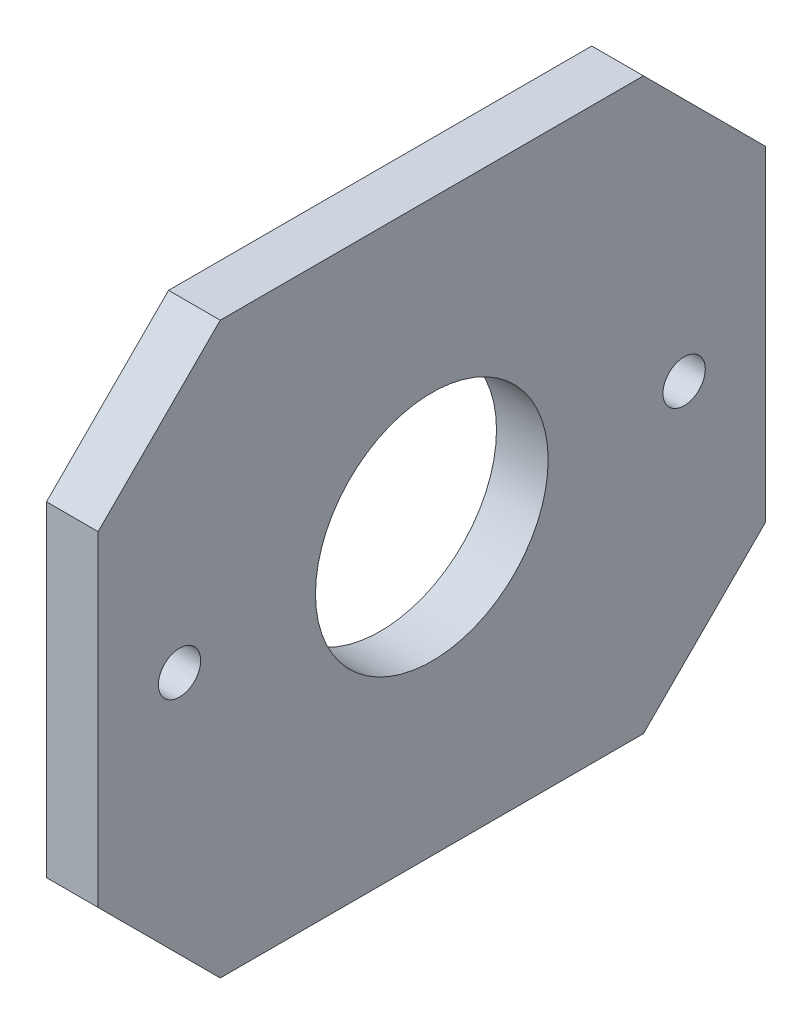
ISO-10303-21;
HEADER;
FILE_DESCRIPTION(('STEP AP214'),'2;1');
FILE_NAME('part.step','',(''),(''),'','','');
FILE_SCHEMA(('AUTOMOTIVE_DESIGN { 1 0 10303 214 1 1 1 1 }'));
ENDSEC;
DATA;
#1=APPLICATION_CONTEXT('core data for automotive mechanical design processes');
#2=APPLICATION_PROTOCOL_DEFINITION('international standard','automotive_design',2000,#1);
#3=PRODUCT_CONTEXT('',#1,'mechanical');
#4=PRODUCT('Part','Part','',(#3));
#5=PRODUCT_RELATED_PRODUCT_CATEGORY('part','',(#4));
#6=PRODUCT_DEFINITION_FORMATION('','',#4);
#7=PRODUCT_DEFINITION_CONTEXT('part definition',#1,'design');
#8=PRODUCT_DEFINITION('design','',#6,#7);
#9=PRODUCT_DEFINITION_SHAPE('','',#8);
#10=(LENGTH_UNIT() NAMED_UNIT(*) SI_UNIT(.MILLI.,.METRE.));
#11=(NAMED_UNIT(*) PLANE_ANGLE_UNIT() SI_UNIT($,.RADIAN.));
#12=(NAMED_UNIT(*) SI_UNIT($,.STERADIAN.) SOLID_ANGLE_UNIT());
#13=UNCERTAINTY_MEASURE_WITH_UNIT(LENGTH_MEASURE(1.E-05),#10,'distance_accuracy_value','');
#14=(GEOMETRIC_REPRESENTATION_CONTEXT(3) GLOBAL_UNCERTAINTY_ASSIGNED_CONTEXT((#13)) GLOBAL_UNIT_ASSIGNED_CONTEXT((#10,
#11,#12)) REPRESENTATION_CONTEXT('',''));
#15=CARTESIAN_POINT('',(0.,0.,0.));
#16=DIRECTION('',(0.,0.,1.));
#17=DIRECTION('',(1.,0.,0.));
#18=AXIS2_PLACEMENT_3D('',#15,#16,#17);
#19=CARTESIAN_POINT('',(6.35,0.,0.));
#20=DIRECTION('',(1.,0.,0.));
#21=DIRECTION('',(0.,0.,-1.));
#22=AXIS2_PLACEMENT_3D('',#19,#20,#21);
#23=PLANE('',#22);
#24=CARTESIAN_POINT('',(6.35,0.,31.));
#25=DIRECTION('',(1.,0.,0.));
#26=DIRECTION('',(0.,0.,-1.));
#27=AXIS2_PLACEMENT_3D('',#24,#25,#26);
#28=CIRCLE('',#27,2.6);
#29=CARTESIAN_POINT('',(6.35,0.,28.4));
#30=VERTEX_POINT('',#29);
#31=EDGE_CURVE('E184',#30,#30,#28,.T.);
#32=ORIENTED_EDGE('',*,*,#31,.F.);
#33=EDGE_LOOP('',(#32));
#34=FACE_BOUND('',#33,.T.);
#35=DIRECTION('',(0.,1.,0.));
#36=VECTOR('',#35,1.);
#37=CARTESIAN_POINT('',(6.35,35.,-41.));
#38=LINE('',#37,#36);
#39=CARTESIAN_POINT('',(6.35,-20.,-41.));
#40=VERTEX_POINT('',#39);
#41=CARTESIAN_POINT('',(6.35,19.9999999999999,-41.));
#42=VERTEX_POINT('',#41);
#43=EDGE_CURVE('E179',#40,#42,#38,.T.);
#44=ORIENTED_EDGE('',*,*,#43,.T.);
#45=DIRECTION('',(0.,-0.707106781186549,-0.707106781186546));
#46=VECTOR('',#45,1.);
#47=CARTESIAN_POINT('',(6.35,30.4999999999999,-30.5));
#48=LINE('',#47,#46);
#49=CARTESIAN_POINT('',(6.35,35.,-26.));
#50=VERTEX_POINT('',#49);
#51=EDGE_CURVE('E156',#42,#50,#48,.F.);
#52=ORIENTED_EDGE('',*,*,#51,.T.);
#53=DIRECTION('',(0.,0.,1.));
#54=VECTOR('',#53,1.);
#55=CARTESIAN_POINT('',(6.35,35.,41.));
#56=LINE('',#55,#54);
#57=CARTESIAN_POINT('',(6.35,35.,25.9999999999999));
#58=VERTEX_POINT('',#57);
#59=EDGE_CURVE('E127',#50,#58,#56,.T.);
#60=ORIENTED_EDGE('',*,*,#59,.T.);
#61=DIRECTION('',(0.,0.707106781186546,-0.707106781186549));
#62=VECTOR('',#61,1.);
#63=CARTESIAN_POINT('',(6.35,30.5,30.4999999999999));
#64=LINE('',#63,#62);
#65=CARTESIAN_POINT('',(6.35,20.,41.));
#66=VERTEX_POINT('',#65);
#67=EDGE_CURVE('E151',#58,#66,#64,.F.);
#68=ORIENTED_EDGE('',*,*,#67,.T.);
#69=DIRECTION('',(0.,-1.,0.));
#70=VECTOR('',#69,1.);
#71=CARTESIAN_POINT('',(6.35,35.,41.));
#72=LINE('',#71,#70);
#73=CARTESIAN_POINT('',(6.35,-19.9999999999999,41.));
#74=VERTEX_POINT('',#73);
#75=EDGE_CURVE('E134',#66,#74,#72,.T.);
#76=ORIENTED_EDGE('',*,*,#75,.T.);
#77=DIRECTION('',(0.,0.707106781186549,0.707106781186546));
#78=VECTOR('',#77,1.);
#79=CARTESIAN_POINT('',(6.35,-30.4999999999999,30.5));
#80=LINE('',#79,#78);
#81=CARTESIAN_POINT('',(6.35,-35.,26.));
#82=VERTEX_POINT('',#81);
#83=EDGE_CURVE('E63',#74,#82,#80,.F.);
#84=ORIENTED_EDGE('',*,*,#83,.T.);
#85=DIRECTION('',(0.,0.,-1.));
#86=VECTOR('',#85,1.);
#87=CARTESIAN_POINT('',(6.35,-35.,41.));
#88=LINE('',#87,#86);
#89=CARTESIAN_POINT('',(6.35,-35.,-25.9999999999999));
#90=VERTEX_POINT('',#89);
#91=EDGE_CURVE('E137',#82,#90,#88,.T.);
#92=ORIENTED_EDGE('',*,*,#91,.T.);
#93=DIRECTION('',(0.,-0.707106781186546,0.707106781186549));
#94=VECTOR('',#93,1.);
#95=CARTESIAN_POINT('',(6.35,-30.5,-30.4999999999999));
#96=LINE('',#95,#94);
#97=EDGE_CURVE('E154',#90,#40,#96,.F.);
#98=ORIENTED_EDGE('',*,*,#97,.T.);
#99=EDGE_LOOP('',(#44,#52,#60,#68,#76,#84,#92,#98));
#100=FACE_BOUND('',#99,.T.);
#101=CARTESIAN_POINT('',(6.35,0.,0.));
#102=DIRECTION('',(1.,0.,0.));
#103=DIRECTION('',(0.,0.,-1.));
#104=AXIS2_PLACEMENT_3D('',#101,#102,#103);
#105=CIRCLE('',#104,14.295);
#106=CARTESIAN_POINT('',(6.35,0.,-14.295));
#107=VERTEX_POINT('',#106);
#108=EDGE_CURVE('E172',#107,#107,#105,.T.);
#109=ORIENTED_EDGE('',*,*,#108,.F.);
#110=EDGE_LOOP('',(#109));
#111=FACE_BOUND('',#110,.T.);
#112=CARTESIAN_POINT('',(6.35,0.,-31.));
#113=DIRECTION('',(1.,0.,0.));
#114=DIRECTION('',(0.,0.,-1.));
#115=AXIS2_PLACEMENT_3D('',#112,#113,#114);
#116=CIRCLE('',#115,2.59999999999999);
#117=CARTESIAN_POINT('',(6.35,0.,-33.6));
#118=VERTEX_POINT('',#117);
#119=EDGE_CURVE('E189',#118,#118,#116,.T.);
#120=ORIENTED_EDGE('',*,*,#119,.F.);
#121=EDGE_LOOP('',(#120));
#122=FACE_BOUND('',#121,.T.);
#123=ADVANCED_FACE('F40',(#34,#100,#111,#122),#23,.T.);
#124=CARTESIAN_POINT('',(0.,0.,0.));
#125=DIRECTION('',(1.,0.,0.));
#126=DIRECTION('',(0.,0.,-1.));
#127=AXIS2_PLACEMENT_3D('',#124,#125,#126);
#128=PLANE('',#127);
#129=DIRECTION('',(0.,0.,1.));
#130=VECTOR('',#129,1.);
#131=CARTESIAN_POINT('',(0.,35.,41.));
#132=LINE('',#131,#130);
#133=CARTESIAN_POINT('',(0.,35.,-26.));
#134=VERTEX_POINT('',#133);
#135=CARTESIAN_POINT('',(0.,35.,25.9999999999999));
#136=VERTEX_POINT('',#135);
#137=EDGE_CURVE('E124',#134,#136,#132,.T.);
#138=ORIENTED_EDGE('',*,*,#137,.F.);
#139=DIRECTION('',(0.,0.707106781186549,0.707106781186546));
#140=VECTOR('',#139,1.);
#141=CARTESIAN_POINT('',(0.,35.,-26.));
#142=LINE('',#141,#140);
#143=CARTESIAN_POINT('',(0.,19.9999999999999,-41.));
#144=VERTEX_POINT('',#143);
#145=EDGE_CURVE('E107',#134,#144,#142,.F.);
#146=ORIENTED_EDGE('',*,*,#145,.T.);
#147=DIRECTION('',(0.,1.,0.));
#148=VECTOR('',#147,1.);
#149=CARTESIAN_POINT('',(0.,35.,-41.));
#150=LINE('',#149,#148);
#151=CARTESIAN_POINT('',(0.,-20.,-41.));
#152=VERTEX_POINT('',#151);
#153=EDGE_CURVE('E135',#152,#144,#150,.T.);
#154=ORIENTED_EDGE('',*,*,#153,.F.);
#155=DIRECTION('',(0.,0.707106781186546,-0.707106781186549));
#156=VECTOR('',#155,1.);
#157=CARTESIAN_POINT('',(0.,-20.,-41.));
#158=LINE('',#157,#156);
#159=CARTESIAN_POINT('',(0.,-35.,-25.9999999999999));
#160=VERTEX_POINT('',#159);
#161=EDGE_CURVE('E118',#152,#160,#158,.F.);
#162=ORIENTED_EDGE('',*,*,#161,.T.);
#163=DIRECTION('',(0.,0.,-1.));
#164=VECTOR('',#163,1.);
#165=CARTESIAN_POINT('',(0.,-35.,41.));
#166=LINE('',#165,#164);
#167=CARTESIAN_POINT('',(0.,-35.,26.));
#168=VERTEX_POINT('',#167);
#169=EDGE_CURVE('E139',#168,#160,#166,.T.);
#170=ORIENTED_EDGE('',*,*,#169,.F.);
#171=DIRECTION('',(0.,-0.707106781186549,-0.707106781186546));
#172=VECTOR('',#171,1.);
#173=CARTESIAN_POINT('',(0.,-35.,26.));
#174=LINE('',#173,#172);
#175=CARTESIAN_POINT('',(0.,-19.9999999999999,41.));
#176=VERTEX_POINT('',#175);
#177=EDGE_CURVE('E145',#168,#176,#174,.F.);
#178=ORIENTED_EDGE('',*,*,#177,.T.);
#179=DIRECTION('',(0.,-1.,0.));
#180=VECTOR('',#179,1.);
#181=CARTESIAN_POINT('',(0.,35.,41.));
#182=LINE('',#181,#180);
#183=CARTESIAN_POINT('',(0.,20.,41.));
#184=VERTEX_POINT('',#183);
#185=EDGE_CURVE('E167',#184,#176,#182,.T.);
#186=ORIENTED_EDGE('',*,*,#185,.F.);
#187=DIRECTION('',(0.,-0.707106781186546,0.707106781186549));
#188=VECTOR('',#187,1.);
#189=CARTESIAN_POINT('',(0.,20.,41.));
#190=LINE('',#189,#188);
#191=EDGE_CURVE('E128',#184,#136,#190,.F.);
#192=ORIENTED_EDGE('',*,*,#191,.T.);
#193=EDGE_LOOP('',(#138,#146,#154,#162,#170,#178,#186,#192));
#194=FACE_BOUND('',#193,.T.);
#195=CARTESIAN_POINT('',(0.,0.,0.));
#196=DIRECTION('',(1.,0.,0.));
#197=DIRECTION('',(0.,0.,-1.));
#198=AXIS2_PLACEMENT_3D('',#195,#196,#197);
#199=CIRCLE('',#198,14.295);
#200=CARTESIAN_POINT('',(0.,0.,-14.295));
#201=VERTEX_POINT('',#200);
#202=EDGE_CURVE('E175',#201,#201,#199,.T.);
#203=ORIENTED_EDGE('',*,*,#202,.T.);
#204=EDGE_LOOP('',(#203));
#205=FACE_BOUND('',#204,.T.);
#206=CARTESIAN_POINT('',(0.,0.,31.));
#207=DIRECTION('',(1.,0.,0.));
#208=DIRECTION('',(0.,0.,-1.));
#209=AXIS2_PLACEMENT_3D('',#206,#207,#208);
#210=CIRCLE('',#209,2.6);
#211=CARTESIAN_POINT('',(0.,0.,28.4));
#212=VERTEX_POINT('',#211);
#213=EDGE_CURVE('E186',#212,#212,#210,.T.);
#214=ORIENTED_EDGE('',*,*,#213,.T.);
#215=EDGE_LOOP('',(#214));
#216=FACE_BOUND('',#215,.T.);
#217=CARTESIAN_POINT('',(0.,0.,-31.));
#218=DIRECTION('',(1.,0.,0.));
#219=DIRECTION('',(0.,0.,-1.));
#220=AXIS2_PLACEMENT_3D('',#217,#218,#219);
#221=CIRCLE('',#220,2.59999999999999);
#222=CARTESIAN_POINT('',(0.,0.,-33.6));
#223=VERTEX_POINT('',#222);
#224=EDGE_CURVE('E192',#223,#223,#221,.T.);
#225=ORIENTED_EDGE('',*,*,#224,.T.);
#226=EDGE_LOOP('',(#225));
#227=FACE_BOUND('',#226,.T.);
#228=ADVANCED_FACE('F131',(#194,#205,#216,#227),#128,.F.);
#229=CARTESIAN_POINT('',(6.35,35.,41.));
#230=DIRECTION('',(0.,0.,-1.));
#231=DIRECTION('',(-1.,0.,0.));
#232=AXIS2_PLACEMENT_3D('',#229,#230,#231);
#233=PLANE('',#232);
#234=ORIENTED_EDGE('',*,*,#185,.T.);
#235=DIRECTION('',(1.,0.,0.));
#236=VECTOR('',#235,1.);
#237=CARTESIAN_POINT('',(6.35,-19.9999999999999,41.));
#238=LINE('',#237,#236);
#239=EDGE_CURVE('E11',#176,#74,#238,.T.);
#240=ORIENTED_EDGE('',*,*,#239,.T.);
#241=ORIENTED_EDGE('',*,*,#75,.F.);
#242=DIRECTION('',(-1.,0.,0.));
#243=VECTOR('',#242,1.);
#244=CARTESIAN_POINT('',(6.35,20.,41.));
#245=LINE('',#244,#243);
#246=EDGE_CURVE('E49',#66,#184,#245,.T.);
#247=ORIENTED_EDGE('',*,*,#246,.T.);
#248=EDGE_LOOP('',(#234,#240,#241,#247));
#249=FACE_BOUND('',#248,.T.);
#250=ADVANCED_FACE('F166',(#249),#233,.F.);
#251=CARTESIAN_POINT('',(6.35,-35.,41.));
#252=DIRECTION('',(0.,1.,0.));
#253=DIRECTION('',(0.,0.,1.));
#254=AXIS2_PLACEMENT_3D('',#251,#252,#253);
#255=PLANE('',#254);
#256=ORIENTED_EDGE('',*,*,#169,.T.);
#257=DIRECTION('',(1.,0.,0.));
#258=VECTOR('',#257,1.);
#259=CARTESIAN_POINT('',(6.35,-35.,-25.9999999999999));
#260=LINE('',#259,#258);
#261=EDGE_CURVE('E56',#160,#90,#260,.T.);
#262=ORIENTED_EDGE('',*,*,#261,.T.);
#263=ORIENTED_EDGE('',*,*,#91,.F.);
#264=DIRECTION('',(-1.,0.,0.));
#265=VECTOR('',#264,1.);
#266=CARTESIAN_POINT('',(6.35,-35.,26.));
#267=LINE('',#266,#265);
#268=EDGE_CURVE('E158',#82,#168,#267,.T.);
#269=ORIENTED_EDGE('',*,*,#268,.T.);
#270=EDGE_LOOP('',(#256,#262,#263,#269));
#271=FACE_BOUND('',#270,.T.);
#272=ADVANCED_FACE('F219',(#271),#255,.F.);
#273=CARTESIAN_POINT('',(6.35,35.,-41.));
#274=DIRECTION('',(0.,0.,1.));
#275=DIRECTION('',(1.,0.,0.));
#276=AXIS2_PLACEMENT_3D('',#273,#274,#275);
#277=PLANE('',#276);
#278=ORIENTED_EDGE('',*,*,#153,.T.);
#279=DIRECTION('',(1.,0.,0.));
#280=VECTOR('',#279,1.);
#281=CARTESIAN_POINT('',(6.35,19.9999999999999,-41.));
#282=LINE('',#281,#280);
#283=EDGE_CURVE('E112',#144,#42,#282,.T.);
#284=ORIENTED_EDGE('',*,*,#283,.T.);
#285=ORIENTED_EDGE('',*,*,#43,.F.);
#286=DIRECTION('',(-1.,0.,0.));
#287=VECTOR('',#286,1.);
#288=CARTESIAN_POINT('',(6.35,-20.,-41.));
#289=LINE('',#288,#287);
#290=EDGE_CURVE('E117',#40,#152,#289,.T.);
#291=ORIENTED_EDGE('',*,*,#290,.T.);
#292=EDGE_LOOP('',(#278,#284,#285,#291));
#293=FACE_BOUND('',#292,.T.);
#294=ADVANCED_FACE('F216',(#293),#277,.F.);
#295=CARTESIAN_POINT('',(6.35,35.,41.));
#296=DIRECTION('',(0.,-1.,0.));
#297=DIRECTION('',(0.,0.,-1.));
#298=AXIS2_PLACEMENT_3D('',#295,#296,#297);
#299=PLANE('',#298);
#300=ORIENTED_EDGE('',*,*,#59,.F.);
#301=DIRECTION('',(-1.,0.,0.));
#302=VECTOR('',#301,1.);
#303=CARTESIAN_POINT('',(6.35,35.,-26.));
#304=LINE('',#303,#302);
#305=EDGE_CURVE('E111',#50,#134,#304,.T.);
#306=ORIENTED_EDGE('',*,*,#305,.T.);
#307=ORIENTED_EDGE('',*,*,#137,.T.);
#308=DIRECTION('',(1.,0.,0.));
#309=VECTOR('',#308,1.);
#310=CARTESIAN_POINT('',(6.35,35.,25.9999999999999));
#311=LINE('',#310,#309);
#312=EDGE_CURVE('E129',#136,#58,#311,.T.);
#313=ORIENTED_EDGE('',*,*,#312,.T.);
#314=EDGE_LOOP('',(#300,#306,#307,#313));
#315=FACE_BOUND('',#314,.T.);
#316=ADVANCED_FACE('F123',(#315),#299,.F.);
#317=CARTESIAN_POINT('',(6.35,0.,0.));
#318=DIRECTION('',(-1.,0.,0.));
#319=DIRECTION('',(0.,0.,1.));
#320=AXIS2_PLACEMENT_3D('',#317,#318,#319);
#321=CYLINDRICAL_SURFACE('',#320,14.295);
#322=ORIENTED_EDGE('',*,*,#108,.T.);
#323=EDGE_LOOP('',(#322));
#324=FACE_BOUND('',#323,.T.);
#325=ORIENTED_EDGE('',*,*,#202,.F.);
#326=EDGE_LOOP('',(#325));
#327=FACE_BOUND('',#326,.T.);
#328=ADVANCED_FACE('F211',(#324,#327),#321,.F.);
#329=CARTESIAN_POINT('',(6.35,0.,31.));
#330=DIRECTION('',(-1.,0.,0.));
#331=DIRECTION('',(0.,0.,1.));
#332=AXIS2_PLACEMENT_3D('',#329,#330,#331);
#333=CYLINDRICAL_SURFACE('',#332,2.6);
#334=ORIENTED_EDGE('',*,*,#31,.T.);
#335=EDGE_LOOP('',(#334));
#336=FACE_BOUND('',#335,.T.);
#337=ORIENTED_EDGE('',*,*,#213,.F.);
#338=EDGE_LOOP('',(#337));
#339=FACE_BOUND('',#338,.T.);
#340=ADVANCED_FACE('F254',(#336,#339),#333,.F.);
#341=CARTESIAN_POINT('',(6.35,0.,-31.));
#342=DIRECTION('',(-1.,0.,0.));
#343=DIRECTION('',(0.,0.,1.));
#344=AXIS2_PLACEMENT_3D('',#341,#342,#343);
#345=CYLINDRICAL_SURFACE('',#344,2.59999999999999);
#346=ORIENTED_EDGE('',*,*,#119,.T.);
#347=EDGE_LOOP('',(#346));
#348=FACE_BOUND('',#347,.T.);
#349=ORIENTED_EDGE('',*,*,#224,.F.);
#350=EDGE_LOOP('',(#349));
#351=FACE_BOUND('',#350,.T.);
#352=ADVANCED_FACE('F198',(#348,#351),#345,.F.);
#353=CARTESIAN_POINT('',(6.35,35.,-26.));
#354=DIRECTION('',(0.,-0.707106781186546,0.707106781186549));
#355=DIRECTION('',(-1.,0.,0.));
#356=AXIS2_PLACEMENT_3D('',#353,#354,#355);
#357=PLANE('',#356);
#358=ORIENTED_EDGE('',*,*,#51,.F.);
#359=ORIENTED_EDGE('',*,*,#283,.F.);
#360=ORIENTED_EDGE('',*,*,#145,.F.);
#361=ORIENTED_EDGE('',*,*,#305,.F.);
#362=EDGE_LOOP('',(#358,#359,#360,#361));
#363=FACE_BOUND('',#362,.T.);
#364=ADVANCED_FACE('F110',(#363),#357,.F.);
#365=CARTESIAN_POINT('',(6.35,-20.,-41.));
#366=DIRECTION('',(0.,0.707106781186549,0.707106781186546));
#367=DIRECTION('',(-1.,0.,0.));
#368=AXIS2_PLACEMENT_3D('',#365,#366,#367);
#369=PLANE('',#368);
#370=ORIENTED_EDGE('',*,*,#97,.F.);
#371=ORIENTED_EDGE('',*,*,#261,.F.);
#372=ORIENTED_EDGE('',*,*,#161,.F.);
#373=ORIENTED_EDGE('',*,*,#290,.F.);
#374=EDGE_LOOP('',(#370,#371,#372,#373));
#375=FACE_BOUND('',#374,.T.);
#376=ADVANCED_FACE('F231',(#375),#369,.F.);
#377=CARTESIAN_POINT('',(6.35,-35.,26.));
#378=DIRECTION('',(0.,0.707106781186546,-0.707106781186549));
#379=DIRECTION('',(-1.,0.,0.));
#380=AXIS2_PLACEMENT_3D('',#377,#378,#379);
#381=PLANE('',#380);
#382=ORIENTED_EDGE('',*,*,#83,.F.);
#383=ORIENTED_EDGE('',*,*,#239,.F.);
#384=ORIENTED_EDGE('',*,*,#177,.F.);
#385=ORIENTED_EDGE('',*,*,#268,.F.);
#386=EDGE_LOOP('',(#382,#383,#384,#385));
#387=FACE_BOUND('',#386,.T.);
#388=ADVANCED_FACE('F236',(#387),#381,.F.);
#389=CARTESIAN_POINT('',(6.35,20.,41.));
#390=DIRECTION('',(0.,-0.707106781186549,-0.707106781186546));
#391=DIRECTION('',(-1.,0.,0.));
#392=AXIS2_PLACEMENT_3D('',#389,#390,#391);
#393=PLANE('',#392);
#394=ORIENTED_EDGE('',*,*,#67,.F.);
#395=ORIENTED_EDGE('',*,*,#312,.F.);
#396=ORIENTED_EDGE('',*,*,#191,.F.);
#397=ORIENTED_EDGE('',*,*,#246,.F.);
#398=EDGE_LOOP('',(#394,#395,#396,#397));
#399=FACE_BOUND('',#398,.T.);
#400=ADVANCED_FACE('F43',(#399),#393,.F.);
#401=CLOSED_SHELL('',(#123,#228,#250,#272,#294,#316,#328,#340,#352,#364,#376,#388,#400));
#402=MANIFOLD_SOLID_BREP('B2',#401);
#403=ADVANCED_BREP_SHAPE_REPRESENTATION('',(#18,#402),#14);
#404=SHAPE_DEFINITION_REPRESENTATION(#9,#403);
ENDSEC;
END-ISO-10303-21;
